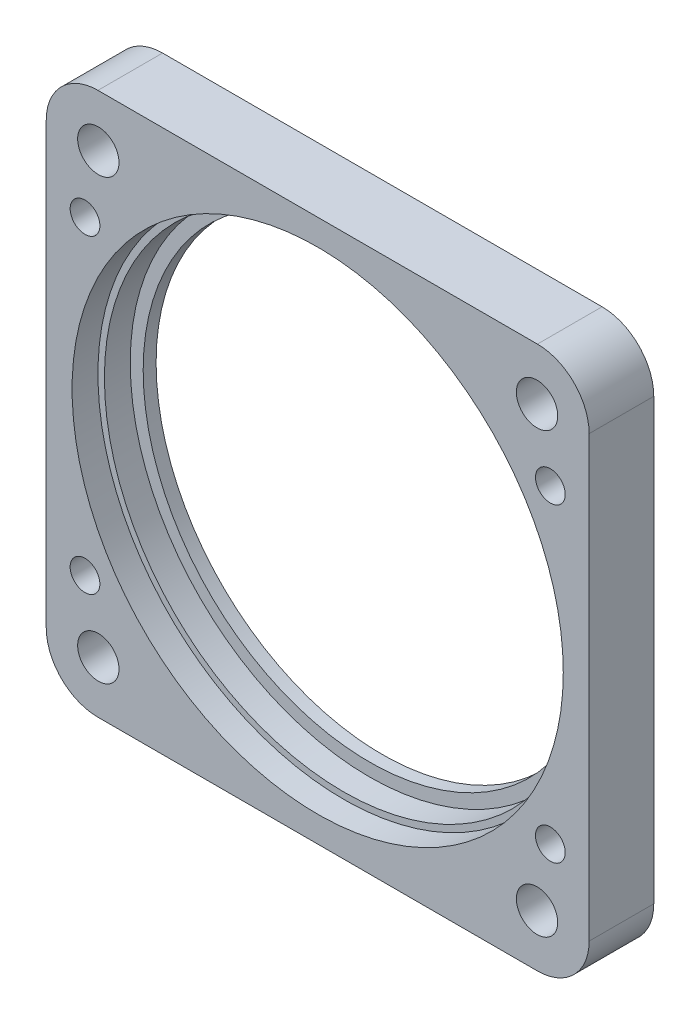
ISO-10303-21;
HEADER;
FILE_DESCRIPTION(('STEP AP214'),'2;1');
FILE_NAME('part.step','',(''),(''),'','','');
FILE_SCHEMA(('AUTOMOTIVE_DESIGN { 1 0 10303 214 1 1 1 1 }'));
ENDSEC;
DATA;
#1=APPLICATION_CONTEXT('core data for automotive mechanical design processes');
#2=APPLICATION_PROTOCOL_DEFINITION('international standard','automotive_design',2000,#1);
#3=PRODUCT_CONTEXT('',#1,'mechanical');
#4=PRODUCT('Part','Part','',(#3));
#5=PRODUCT_RELATED_PRODUCT_CATEGORY('part','',(#4));
#6=PRODUCT_DEFINITION_FORMATION('','',#4);
#7=PRODUCT_DEFINITION_CONTEXT('part definition',#1,'design');
#8=PRODUCT_DEFINITION('design','',#6,#7);
#9=PRODUCT_DEFINITION_SHAPE('','',#8);
#10=(LENGTH_UNIT() NAMED_UNIT(*) SI_UNIT(.MILLI.,.METRE.));
#11=(NAMED_UNIT(*) PLANE_ANGLE_UNIT() SI_UNIT($,.RADIAN.));
#12=(NAMED_UNIT(*) SI_UNIT($,.STERADIAN.) SOLID_ANGLE_UNIT());
#13=UNCERTAINTY_MEASURE_WITH_UNIT(LENGTH_MEASURE(1.E-05),#10,'distance_accuracy_value','');
#14=(GEOMETRIC_REPRESENTATION_CONTEXT(3) GLOBAL_UNCERTAINTY_ASSIGNED_CONTEXT((#13)) GLOBAL_UNIT_ASSIGNED_CONTEXT((#10,
#11,#12)) REPRESENTATION_CONTEXT('',''));
#15=CARTESIAN_POINT('',(0.,0.,0.));
#16=DIRECTION('',(0.,0.,1.));
#17=DIRECTION('',(1.,0.,0.));
#18=AXIS2_PLACEMENT_3D('',#15,#16,#17);
#19=CARTESIAN_POINT('',(18.,12.,5.));
#20=DIRECTION('',(0.,0.,-1.));
#21=DIRECTION('',(-1.,0.,0.));
#22=AXIS2_PLACEMENT_3D('',#19,#20,#21);
#23=CYLINDRICAL_SURFACE('',#22,1.15);
#24=CARTESIAN_POINT('',(18.,12.,5.));
#25=DIRECTION('',(0.,0.,-1.));
#26=DIRECTION('',(-1.,0.,0.));
#27=AXIS2_PLACEMENT_3D('',#24,#25,#26);
#28=CIRCLE('',#27,1.15);
#29=CARTESIAN_POINT('',(16.85,12.,5.));
#30=VERTEX_POINT('',#29);
#31=EDGE_CURVE('E199',#30,#30,#28,.T.);
#32=ORIENTED_EDGE('',*,*,#31,.F.);
#33=EDGE_LOOP('',(#32));
#34=FACE_BOUND('',#33,.T.);
#35=CARTESIAN_POINT('',(18.,12.,3.));
#36=DIRECTION('',(0.,0.,-1.));
#37=DIRECTION('',(-1.,0.,0.));
#38=AXIS2_PLACEMENT_3D('',#35,#36,#37);
#39=CIRCLE('',#38,1.15);
#40=CARTESIAN_POINT('',(16.85,12.,3.));
#41=VERTEX_POINT('',#40);
#42=EDGE_CURVE('E46',#41,#41,#39,.F.);
#43=ORIENTED_EDGE('',*,*,#42,.F.);
#44=EDGE_LOOP('',(#43));
#45=FACE_BOUND('',#44,.T.);
#46=ADVANCED_FACE('F42',(#34,#45),#23,.F.);
#47=CARTESIAN_POINT('',(-18.,-12.,5.));
#48=DIRECTION('',(0.,0.,-1.));
#49=DIRECTION('',(-1.,0.,0.));
#50=AXIS2_PLACEMENT_3D('',#47,#48,#49);
#51=CYLINDRICAL_SURFACE('',#50,1.15);
#52=CARTESIAN_POINT('',(-18.,-12.,5.));
#53=DIRECTION('',(0.,0.,-1.));
#54=DIRECTION('',(-1.,0.,0.));
#55=AXIS2_PLACEMENT_3D('',#52,#53,#54);
#56=CIRCLE('',#55,1.15);
#57=CARTESIAN_POINT('',(-19.15,-12.,5.));
#58=VERTEX_POINT('',#57);
#59=EDGE_CURVE('E190',#58,#58,#56,.T.);
#60=ORIENTED_EDGE('',*,*,#59,.F.);
#61=EDGE_LOOP('',(#60));
#62=FACE_BOUND('',#61,.T.);
#63=CARTESIAN_POINT('',(-18.,-12.,3.));
#64=DIRECTION('',(0.,0.,-1.));
#65=DIRECTION('',(-1.,0.,0.));
#66=AXIS2_PLACEMENT_3D('',#63,#64,#65);
#67=CIRCLE('',#66,1.15);
#68=CARTESIAN_POINT('',(-19.15,-12.,3.));
#69=VERTEX_POINT('',#68);
#70=EDGE_CURVE('E178',#69,#69,#67,.F.);
#71=ORIENTED_EDGE('',*,*,#70,.F.);
#72=EDGE_LOOP('',(#71));
#73=FACE_BOUND('',#72,.T.);
#74=ADVANCED_FACE('F262',(#62,#73),#51,.F.);
#75=CARTESIAN_POINT('',(0.,0.,-52.3259018078045));
#76=DIRECTION('',(0.,0.,1.));
#77=DIRECTION('',(1.,0.,0.));
#78=AXIS2_PLACEMENT_3D('',#75,#76,#77);
#79=CYLINDRICAL_SURFACE('',#78,18.5);
#80=CARTESIAN_POINT('',(0.,0.,1.));
#81=DIRECTION('',(0.,0.,1.));
#82=DIRECTION('',(1.,0.,0.));
#83=AXIS2_PLACEMENT_3D('',#80,#81,#82);
#84=CIRCLE('',#83,18.5);
#85=CARTESIAN_POINT('',(18.5,0.,1.));
#86=VERTEX_POINT('',#85);
#87=EDGE_CURVE('E149',#86,#86,#84,.F.);
#88=ORIENTED_EDGE('',*,*,#87,.T.);
#89=EDGE_LOOP('',(#88));
#90=FACE_BOUND('',#89,.T.);
#91=CARTESIAN_POINT('',(0.,0.,3.));
#92=DIRECTION('',(0.,0.,1.));
#93=DIRECTION('',(1.,0.,0.));
#94=AXIS2_PLACEMENT_3D('',#91,#92,#93);
#95=CIRCLE('',#94,18.5);
#96=CARTESIAN_POINT('',(18.5,0.,3.));
#97=VERTEX_POINT('',#96);
#98=EDGE_CURVE('E150',#97,#97,#95,.F.);
#99=ORIENTED_EDGE('',*,*,#98,.F.);
#100=EDGE_LOOP('',(#99));
#101=FACE_BOUND('',#100,.T.);
#102=ADVANCED_FACE('F268',(#90,#101),#79,.F.);
#103=CARTESIAN_POINT('',(0.,0.,0.));
#104=DIRECTION('',(0.,0.,1.));
#105=DIRECTION('',(1.,0.,0.));
#106=AXIS2_PLACEMENT_3D('',#103,#104,#105);
#107=CYLINDRICAL_SURFACE('',#106,17.5);
#108=CARTESIAN_POINT('',(0.,0.,0.));
#109=DIRECTION('',(0.,0.,1.));
#110=DIRECTION('',(1.,0.,0.));
#111=AXIS2_PLACEMENT_3D('',#108,#109,#110);
#112=CIRCLE('',#111,17.5);
#113=CARTESIAN_POINT('',(17.5,0.,0.));
#114=VERTEX_POINT('',#113);
#115=EDGE_CURVE('E148',#114,#114,#112,.T.);
#116=ORIENTED_EDGE('',*,*,#115,.F.);
#117=EDGE_LOOP('',(#116));
#118=FACE_BOUND('',#117,.T.);
#119=CARTESIAN_POINT('',(0.,0.,1.));
#120=DIRECTION('',(0.,0.,1.));
#121=DIRECTION('',(1.,0.,0.));
#122=AXIS2_PLACEMENT_3D('',#119,#120,#121);
#123=CIRCLE('',#122,17.5);
#124=CARTESIAN_POINT('',(17.5,0.,1.));
#125=VERTEX_POINT('',#124);
#126=EDGE_CURVE('E145',#125,#125,#123,.F.);
#127=ORIENTED_EDGE('',*,*,#126,.F.);
#128=EDGE_LOOP('',(#127));
#129=FACE_BOUND('',#128,.T.);
#130=ADVANCED_FACE('F307',(#118,#129),#107,.F.);
#131=CARTESIAN_POINT('',(21.,21.,5.));
#132=DIRECTION('',(-1.,0.,0.));
#133=DIRECTION('',(0.,-1.,0.));
#134=AXIS2_PLACEMENT_3D('',#131,#132,#133);
#135=PLANE('',#134);
#136=DIRECTION('',(0.,1.,0.));
#137=VECTOR('',#136,1.);
#138=CARTESIAN_POINT('',(21.,21.,5.));
#139=LINE('',#138,#137);
#140=CARTESIAN_POINT('',(21.,-17.,5.));
#141=VERTEX_POINT('',#140);
#142=CARTESIAN_POINT('',(21.,17.,5.));
#143=VERTEX_POINT('',#142);
#144=EDGE_CURVE('E136',#141,#143,#139,.T.);
#145=ORIENTED_EDGE('',*,*,#144,.F.);
#146=DIRECTION('',(0.,0.,-1.));
#147=VECTOR('',#146,1.);
#148=CARTESIAN_POINT('',(21.,-17.,5.));
#149=LINE('',#148,#147);
#150=CARTESIAN_POINT('',(21.,-17.,0.));
#151=VERTEX_POINT('',#150);
#152=EDGE_CURVE('E171',#141,#151,#149,.T.);
#153=ORIENTED_EDGE('',*,*,#152,.T.);
#154=DIRECTION('',(0.,1.,0.));
#155=VECTOR('',#154,1.);
#156=CARTESIAN_POINT('',(21.,21.,0.));
#157=LINE('',#156,#155);
#158=CARTESIAN_POINT('',(21.,17.,0.));
#159=VERTEX_POINT('',#158);
#160=EDGE_CURVE('E234',#151,#159,#157,.T.);
#161=ORIENTED_EDGE('',*,*,#160,.T.);
#162=DIRECTION('',(0.,0.,-1.));
#163=VECTOR('',#162,1.);
#164=CARTESIAN_POINT('',(21.,17.,5.));
#165=LINE('',#164,#163);
#166=EDGE_CURVE('E169',#159,#143,#165,.F.);
#167=ORIENTED_EDGE('',*,*,#166,.T.);
#168=EDGE_LOOP('',(#145,#153,#161,#167));
#169=FACE_BOUND('',#168,.T.);
#170=ADVANCED_FACE('F259',(#169),#135,.F.);
#171=CARTESIAN_POINT('',(-21.,21.,5.));
#172=DIRECTION('',(0.,-1.,0.));
#173=DIRECTION('',(0.,0.,-1.));
#174=AXIS2_PLACEMENT_3D('',#171,#172,#173);
#175=PLANE('',#174);
#176=DIRECTION('',(-1.,0.,0.));
#177=VECTOR('',#176,1.);
#178=CARTESIAN_POINT('',(-21.,21.,5.));
#179=LINE('',#178,#177);
#180=CARTESIAN_POINT('',(17.,21.,5.));
#181=VERTEX_POINT('',#180);
#182=CARTESIAN_POINT('',(-17.,21.,5.));
#183=VERTEX_POINT('',#182);
#184=EDGE_CURVE('E139',#181,#183,#179,.T.);
#185=ORIENTED_EDGE('',*,*,#184,.F.);
#186=DIRECTION('',(0.,0.,-1.));
#187=VECTOR('',#186,1.);
#188=CARTESIAN_POINT('',(17.,21.,5.));
#189=LINE('',#188,#187);
#190=CARTESIAN_POINT('',(17.,21.,0.));
#191=VERTEX_POINT('',#190);
#192=EDGE_CURVE('E13',#181,#191,#189,.T.);
#193=ORIENTED_EDGE('',*,*,#192,.T.);
#194=DIRECTION('',(-1.,0.,0.));
#195=VECTOR('',#194,1.);
#196=CARTESIAN_POINT('',(-21.,21.,0.));
#197=LINE('',#196,#195);
#198=CARTESIAN_POINT('',(-17.,21.,0.));
#199=VERTEX_POINT('',#198);
#200=EDGE_CURVE('E141',#191,#199,#197,.T.);
#201=ORIENTED_EDGE('',*,*,#200,.T.);
#202=DIRECTION('',(0.,0.,-1.));
#203=VECTOR('',#202,1.);
#204=CARTESIAN_POINT('',(-17.,21.,5.));
#205=LINE('',#204,#203);
#206=EDGE_CURVE('E51',#199,#183,#205,.F.);
#207=ORIENTED_EDGE('',*,*,#206,.T.);
#208=EDGE_LOOP('',(#185,#193,#201,#207));
#209=FACE_BOUND('',#208,.T.);
#210=ADVANCED_FACE('F243',(#209),#175,.F.);
#211=CARTESIAN_POINT('',(-21.,21.,5.));
#212=DIRECTION('',(1.,0.,0.));
#213=DIRECTION('',(0.,0.,-1.));
#214=AXIS2_PLACEMENT_3D('',#211,#212,#213);
#215=PLANE('',#214);
#216=DIRECTION('',(0.,-1.,0.));
#217=VECTOR('',#216,1.);
#218=CARTESIAN_POINT('',(-21.,21.,0.));
#219=LINE('',#218,#217);
#220=CARTESIAN_POINT('',(-21.,17.,0.));
#221=VERTEX_POINT('',#220);
#222=CARTESIAN_POINT('',(-21.,-17.,0.));
#223=VERTEX_POINT('',#222);
#224=EDGE_CURVE('E137',#221,#223,#219,.T.);
#225=ORIENTED_EDGE('',*,*,#224,.T.);
#226=DIRECTION('',(0.,0.,-1.));
#227=VECTOR('',#226,1.);
#228=CARTESIAN_POINT('',(-21.,-17.,5.));
#229=LINE('',#228,#227);
#230=CARTESIAN_POINT('',(-21.,-17.,5.));
#231=VERTEX_POINT('',#230);
#232=EDGE_CURVE('E115',#223,#231,#229,.F.);
#233=ORIENTED_EDGE('',*,*,#232,.T.);
#234=DIRECTION('',(0.,-1.,0.));
#235=VECTOR('',#234,1.);
#236=CARTESIAN_POINT('',(-21.,21.,5.));
#237=LINE('',#236,#235);
#238=CARTESIAN_POINT('',(-21.,17.,5.));
#239=VERTEX_POINT('',#238);
#240=EDGE_CURVE('E237',#239,#231,#237,.T.);
#241=ORIENTED_EDGE('',*,*,#240,.F.);
#242=DIRECTION('',(0.,0.,-1.));
#243=VECTOR('',#242,1.);
#244=CARTESIAN_POINT('',(-21.,17.,5.));
#245=LINE('',#244,#243);
#246=EDGE_CURVE('E120',#239,#221,#245,.T.);
#247=ORIENTED_EDGE('',*,*,#246,.T.);
#248=EDGE_LOOP('',(#225,#233,#241,#247));
#249=FACE_BOUND('',#248,.T.);
#250=ADVANCED_FACE('F251',(#249),#215,.F.);
#251=CARTESIAN_POINT('',(-21.,-21.,5.));
#252=DIRECTION('',(0.,1.,0.));
#253=DIRECTION('',(0.,0.,1.));
#254=AXIS2_PLACEMENT_3D('',#251,#252,#253);
#255=PLANE('',#254);
#256=DIRECTION('',(1.,0.,0.));
#257=VECTOR('',#256,1.);
#258=CARTESIAN_POINT('',(-21.,-21.,5.));
#259=LINE('',#258,#257);
#260=CARTESIAN_POINT('',(-17.,-21.,5.));
#261=VERTEX_POINT('',#260);
#262=CARTESIAN_POINT('',(17.,-21.,5.));
#263=VERTEX_POINT('',#262);
#264=EDGE_CURVE('E130',#261,#263,#259,.T.);
#265=ORIENTED_EDGE('',*,*,#264,.F.);
#266=DIRECTION('',(0.,0.,-1.));
#267=VECTOR('',#266,1.);
#268=CARTESIAN_POINT('',(-17.,-21.,5.));
#269=LINE('',#268,#267);
#270=CARTESIAN_POINT('',(-17.,-21.,0.));
#271=VERTEX_POINT('',#270);
#272=EDGE_CURVE('E114',#261,#271,#269,.T.);
#273=ORIENTED_EDGE('',*,*,#272,.T.);
#274=DIRECTION('',(1.,0.,0.));
#275=VECTOR('',#274,1.);
#276=CARTESIAN_POINT('',(-21.,-21.,0.));
#277=LINE('',#276,#275);
#278=CARTESIAN_POINT('',(17.,-21.,0.));
#279=VERTEX_POINT('',#278);
#280=EDGE_CURVE('E127',#271,#279,#277,.T.);
#281=ORIENTED_EDGE('',*,*,#280,.T.);
#282=DIRECTION('',(0.,0.,-1.));
#283=VECTOR('',#282,1.);
#284=CARTESIAN_POINT('',(17.,-21.,5.));
#285=LINE('',#284,#283);
#286=EDGE_CURVE('E132',#279,#263,#285,.F.);
#287=ORIENTED_EDGE('',*,*,#286,.T.);
#288=EDGE_LOOP('',(#265,#273,#281,#287));
#289=FACE_BOUND('',#288,.T.);
#290=ADVANCED_FACE('F126',(#289),#255,.F.);
#291=CARTESIAN_POINT('',(0.,0.,5.));
#292=DIRECTION('',(0.,0.,1.));
#293=DIRECTION('',(1.,0.,0.));
#294=AXIS2_PLACEMENT_3D('',#291,#292,#293);
#295=PLANE('',#294);
#296=CARTESIAN_POINT('',(18.,-12.,5.));
#297=DIRECTION('',(0.,0.,-1.));
#298=DIRECTION('',(1.,0.,0.));
#299=AXIS2_PLACEMENT_3D('',#296,#297,#298);
#300=CIRCLE('',#299,1.15);
#301=CARTESIAN_POINT('',(19.15,-12.,5.));
#302=VERTEX_POINT('',#301);
#303=EDGE_CURVE('E186',#302,#302,#300,.T.);
#304=ORIENTED_EDGE('',*,*,#303,.T.);
#305=EDGE_LOOP('',(#304));
#306=FACE_BOUND('',#305,.T.);
#307=ORIENTED_EDGE('',*,*,#59,.T.);
#308=EDGE_LOOP('',(#307));
#309=FACE_BOUND('',#308,.T.);
#310=CARTESIAN_POINT('',(-18.,12.,5.));
#311=DIRECTION('',(0.,0.,-1.));
#312=DIRECTION('',(1.,0.,0.));
#313=AXIS2_PLACEMENT_3D('',#310,#311,#312);
#314=CIRCLE('',#313,1.15);
#315=CARTESIAN_POINT('',(-16.85,12.,5.));
#316=VERTEX_POINT('',#315);
#317=EDGE_CURVE('E195',#316,#316,#314,.T.);
#318=ORIENTED_EDGE('',*,*,#317,.T.);
#319=EDGE_LOOP('',(#318));
#320=FACE_BOUND('',#319,.T.);
#321=ORIENTED_EDGE('',*,*,#31,.T.);
#322=EDGE_LOOP('',(#321));
#323=FACE_BOUND('',#322,.T.);
#324=CARTESIAN_POINT('',(-16.9705627484768,-16.9705627484768,5.));
#325=DIRECTION('',(0.,0.,1.));
#326=DIRECTION('',(1.,0.,0.));
#327=AXIS2_PLACEMENT_3D('',#324,#325,#326);
#328=CIRCLE('',#327,1.6);
#329=CARTESIAN_POINT('',(-15.3705627484768,-16.9705627484768,5.));
#330=VERTEX_POINT('',#329);
#331=EDGE_CURVE('E216',#330,#330,#328,.T.);
#332=ORIENTED_EDGE('',*,*,#331,.F.);
#333=EDGE_LOOP('',(#332));
#334=FACE_BOUND('',#333,.T.);
#335=CARTESIAN_POINT('',(16.9705627484774,-16.9705627484768,5.));
#336=DIRECTION('',(0.,0.,1.));
#337=DIRECTION('',(1.,0.,0.));
#338=AXIS2_PLACEMENT_3D('',#335,#336,#337);
#339=CIRCLE('',#338,1.6);
#340=CARTESIAN_POINT('',(18.5705627484774,-16.9705627484768,5.));
#341=VERTEX_POINT('',#340);
#342=EDGE_CURVE('E210',#341,#341,#339,.T.);
#343=ORIENTED_EDGE('',*,*,#342,.F.);
#344=EDGE_LOOP('',(#343));
#345=FACE_BOUND('',#344,.T.);
#346=CARTESIAN_POINT('',(16.9705627484775,16.9705627484774,5.));
#347=DIRECTION('',(0.,0.,1.));
#348=DIRECTION('',(1.,0.,0.));
#349=AXIS2_PLACEMENT_3D('',#346,#347,#348);
#350=CIRCLE('',#349,1.6);
#351=CARTESIAN_POINT('',(18.5705627484775,16.9705627484774,5.));
#352=VERTEX_POINT('',#351);
#353=EDGE_CURVE('E203',#352,#352,#350,.T.);
#354=ORIENTED_EDGE('',*,*,#353,.F.);
#355=EDGE_LOOP('',(#354));
#356=FACE_BOUND('',#355,.T.);
#357=CARTESIAN_POINT('',(-16.9705627484768,16.9705627484775,5.));
#358=DIRECTION('',(0.,0.,1.));
#359=DIRECTION('',(1.,0.,0.));
#360=AXIS2_PLACEMENT_3D('',#357,#358,#359);
#361=CIRCLE('',#360,1.6);
#362=CARTESIAN_POINT('',(-15.3705627484768,16.9705627484775,5.));
#363=VERTEX_POINT('',#362);
#364=EDGE_CURVE('E206',#363,#363,#361,.T.);
#365=ORIENTED_EDGE('',*,*,#364,.F.);
#366=EDGE_LOOP('',(#365));
#367=FACE_BOUND('',#366,.T.);
#368=CARTESIAN_POINT('',(0.,0.,5.));
#369=DIRECTION('',(0.,0.,1.));
#370=DIRECTION('',(1.,0.,0.));
#371=AXIS2_PLACEMENT_3D('',#368,#369,#370);
#372=CIRCLE('',#371,19.);
#373=CARTESIAN_POINT('',(19.,0.,5.));
#374=VERTEX_POINT('',#373);
#375=EDGE_CURVE('E224',#374,#374,#372,.T.);
#376=ORIENTED_EDGE('',*,*,#375,.F.);
#377=EDGE_LOOP('',(#376));
#378=FACE_BOUND('',#377,.T.);
#379=ORIENTED_EDGE('',*,*,#240,.T.);
#380=CARTESIAN_POINT('',(-17.,-17.,5.));
#381=DIRECTION('',(0.,0.,1.));
#382=DIRECTION('',(1.,0.,0.));
#383=AXIS2_PLACEMENT_3D('',#380,#381,#382);
#384=CIRCLE('',#383,4.);
#385=EDGE_CURVE('E167',#231,#261,#384,.T.);
#386=ORIENTED_EDGE('',*,*,#385,.T.);
#387=ORIENTED_EDGE('',*,*,#264,.T.);
#388=CARTESIAN_POINT('',(17.,-17.,5.));
#389=DIRECTION('',(0.,0.,1.));
#390=DIRECTION('',(1.,0.,0.));
#391=AXIS2_PLACEMENT_3D('',#388,#389,#390);
#392=CIRCLE('',#391,4.);
#393=EDGE_CURVE('E165',#263,#141,#392,.T.);
#394=ORIENTED_EDGE('',*,*,#393,.T.);
#395=ORIENTED_EDGE('',*,*,#144,.T.);
#396=CARTESIAN_POINT('',(17.,17.,5.));
#397=DIRECTION('',(0.,0.,1.));
#398=DIRECTION('',(1.,0.,0.));
#399=AXIS2_PLACEMENT_3D('',#396,#397,#398);
#400=CIRCLE('',#399,4.);
#401=EDGE_CURVE('E65',#143,#181,#400,.T.);
#402=ORIENTED_EDGE('',*,*,#401,.T.);
#403=ORIENTED_EDGE('',*,*,#184,.T.);
#404=CARTESIAN_POINT('',(-17.,17.,5.));
#405=DIRECTION('',(0.,0.,1.));
#406=DIRECTION('',(1.,0.,0.));
#407=AXIS2_PLACEMENT_3D('',#404,#405,#406);
#408=CIRCLE('',#407,4.);
#409=EDGE_CURVE('E162',#183,#239,#408,.T.);
#410=ORIENTED_EDGE('',*,*,#409,.T.);
#411=EDGE_LOOP('',(#379,#386,#387,#394,#395,#402,#403,#410));
#412=FACE_BOUND('',#411,.T.);
#413=ADVANCED_FACE('F249',(#306,#309,#320,#323,#334,#345,#356,#367,#378,#412),#295,.T.);
#414=CARTESIAN_POINT('',(0.,0.,0.));
#415=DIRECTION('',(0.,0.,1.));
#416=DIRECTION('',(1.,0.,0.));
#417=AXIS2_PLACEMENT_3D('',#414,#415,#416);
#418=PLANE('',#417);
#419=CARTESIAN_POINT('',(18.,-12.,0.));
#420=DIRECTION('',(0.,0.,-1.));
#421=DIRECTION('',(1.,0.,0.));
#422=AXIS2_PLACEMENT_3D('',#419,#420,#421);
#423=CIRCLE('',#422,2.);
#424=CARTESIAN_POINT('',(20.,-12.,0.));
#425=VERTEX_POINT('',#424);
#426=EDGE_CURVE('E321',#425,#425,#423,.T.);
#427=ORIENTED_EDGE('',*,*,#426,.F.);
#428=EDGE_LOOP('',(#427));
#429=FACE_BOUND('',#428,.T.);
#430=CARTESIAN_POINT('',(-18.,-12.,0.));
#431=DIRECTION('',(0.,0.,-1.));
#432=DIRECTION('',(-1.,0.,0.));
#433=AXIS2_PLACEMENT_3D('',#430,#431,#432);
#434=CIRCLE('',#433,2.);
#435=CARTESIAN_POINT('',(-20.,-12.,0.));
#436=VERTEX_POINT('',#435);
#437=EDGE_CURVE('E325',#436,#436,#434,.T.);
#438=ORIENTED_EDGE('',*,*,#437,.F.);
#439=EDGE_LOOP('',(#438));
#440=FACE_BOUND('',#439,.T.);
#441=CARTESIAN_POINT('',(-18.,12.,0.));
#442=DIRECTION('',(0.,0.,-1.));
#443=DIRECTION('',(1.,0.,0.));
#444=AXIS2_PLACEMENT_3D('',#441,#442,#443);
#445=CIRCLE('',#444,2.);
#446=CARTESIAN_POINT('',(-16.,12.,0.));
#447=VERTEX_POINT('',#446);
#448=EDGE_CURVE('E329',#447,#447,#445,.T.);
#449=ORIENTED_EDGE('',*,*,#448,.F.);
#450=EDGE_LOOP('',(#449));
#451=FACE_BOUND('',#450,.T.);
#452=CARTESIAN_POINT('',(18.,12.,0.));
#453=DIRECTION('',(0.,0.,-1.));
#454=DIRECTION('',(-1.,0.,0.));
#455=AXIS2_PLACEMENT_3D('',#452,#453,#454);
#456=CIRCLE('',#455,2.);
#457=CARTESIAN_POINT('',(16.,12.,0.));
#458=VERTEX_POINT('',#457);
#459=EDGE_CURVE('E333',#458,#458,#456,.T.);
#460=ORIENTED_EDGE('',*,*,#459,.F.);
#461=EDGE_LOOP('',(#460));
#462=FACE_BOUND('',#461,.T.);
#463=CARTESIAN_POINT('',(-16.9705627484768,-16.9705627484768,0.));
#464=DIRECTION('',(0.,0.,1.));
#465=DIRECTION('',(1.,0.,0.));
#466=AXIS2_PLACEMENT_3D('',#463,#464,#465);
#467=CIRCLE('',#466,1.6);
#468=CARTESIAN_POINT('',(-15.3705627484768,-16.9705627484768,0.));
#469=VERTEX_POINT('',#468);
#470=EDGE_CURVE('E202',#469,#469,#467,.T.);
#471=ORIENTED_EDGE('',*,*,#470,.T.);
#472=EDGE_LOOP('',(#471));
#473=FACE_BOUND('',#472,.T.);
#474=CARTESIAN_POINT('',(16.9705627484774,-16.9705627484768,0.));
#475=DIRECTION('',(0.,0.,1.));
#476=DIRECTION('',(1.,0.,0.));
#477=AXIS2_PLACEMENT_3D('',#474,#475,#476);
#478=CIRCLE('',#477,1.6);
#479=CARTESIAN_POINT('',(18.5705627484774,-16.9705627484768,0.));
#480=VERTEX_POINT('',#479);
#481=EDGE_CURVE('E213',#480,#480,#478,.T.);
#482=ORIENTED_EDGE('',*,*,#481,.T.);
#483=EDGE_LOOP('',(#482));
#484=FACE_BOUND('',#483,.T.);
#485=CARTESIAN_POINT('',(16.9705627484775,16.9705627484774,0.));
#486=DIRECTION('',(0.,0.,1.));
#487=DIRECTION('',(1.,0.,0.));
#488=AXIS2_PLACEMENT_3D('',#485,#486,#487);
#489=CIRCLE('',#488,1.6);
#490=CARTESIAN_POINT('',(18.5705627484775,16.9705627484774,0.));
#491=VERTEX_POINT('',#490);
#492=EDGE_CURVE('E207',#491,#491,#489,.T.);
#493=ORIENTED_EDGE('',*,*,#492,.T.);
#494=EDGE_LOOP('',(#493));
#495=FACE_BOUND('',#494,.T.);
#496=CARTESIAN_POINT('',(-16.9705627484768,16.9705627484775,0.));
#497=DIRECTION('',(0.,0.,1.));
#498=DIRECTION('',(1.,0.,0.));
#499=AXIS2_PLACEMENT_3D('',#496,#497,#498);
#500=CIRCLE('',#499,1.6);
#501=CARTESIAN_POINT('',(-15.3705627484768,16.9705627484775,0.));
#502=VERTEX_POINT('',#501);
#503=EDGE_CURVE('E221',#502,#502,#500,.T.);
#504=ORIENTED_EDGE('',*,*,#503,.T.);
#505=EDGE_LOOP('',(#504));
#506=FACE_BOUND('',#505,.T.);
#507=ORIENTED_EDGE('',*,*,#115,.T.);
#508=EDGE_LOOP('',(#507));
#509=FACE_BOUND('',#508,.T.);
#510=ORIENTED_EDGE('',*,*,#280,.F.);
#511=CARTESIAN_POINT('',(-17.,-17.,0.));
#512=DIRECTION('',(0.,0.,1.));
#513=DIRECTION('',(1.,0.,0.));
#514=AXIS2_PLACEMENT_3D('',#511,#512,#513);
#515=CIRCLE('',#514,4.);
#516=EDGE_CURVE('E110',#271,#223,#515,.F.);
#517=ORIENTED_EDGE('',*,*,#516,.T.);
#518=ORIENTED_EDGE('',*,*,#224,.F.);
#519=CARTESIAN_POINT('',(-17.,17.,0.));
#520=DIRECTION('',(0.,0.,1.));
#521=DIRECTION('',(1.,0.,0.));
#522=AXIS2_PLACEMENT_3D('',#519,#520,#521);
#523=CIRCLE('',#522,4.);
#524=EDGE_CURVE('E131',#221,#199,#523,.F.);
#525=ORIENTED_EDGE('',*,*,#524,.T.);
#526=ORIENTED_EDGE('',*,*,#200,.F.);
#527=CARTESIAN_POINT('',(17.,17.,0.));
#528=DIRECTION('',(0.,0.,1.));
#529=DIRECTION('',(1.,0.,0.));
#530=AXIS2_PLACEMENT_3D('',#527,#528,#529);
#531=CIRCLE('',#530,4.);
#532=EDGE_CURVE('E156',#191,#159,#531,.F.);
#533=ORIENTED_EDGE('',*,*,#532,.T.);
#534=ORIENTED_EDGE('',*,*,#160,.F.);
#535=CARTESIAN_POINT('',(17.,-17.,0.));
#536=DIRECTION('',(0.,0.,1.));
#537=DIRECTION('',(1.,0.,0.));
#538=AXIS2_PLACEMENT_3D('',#535,#536,#537);
#539=CIRCLE('',#538,4.);
#540=EDGE_CURVE('E121',#151,#279,#539,.F.);
#541=ORIENTED_EDGE('',*,*,#540,.T.);
#542=EDGE_LOOP('',(#510,#517,#518,#525,#526,#533,#534,#541));
#543=FACE_BOUND('',#542,.T.);
#544=ADVANCED_FACE('F134',(#429,#440,#451,#462,#473,#484,#495,#506,#509,#543),#418,.F.);
#545=CARTESIAN_POINT('',(0.,0.,1.));
#546=DIRECTION('',(0.,0.,1.));
#547=DIRECTION('',(1.,0.,0.));
#548=AXIS2_PLACEMENT_3D('',#545,#546,#547);
#549=PLANE('',#548);
#550=ORIENTED_EDGE('',*,*,#87,.F.);
#551=EDGE_LOOP('',(#550));
#552=FACE_BOUND('',#551,.T.);
#553=ORIENTED_EDGE('',*,*,#126,.T.);
#554=EDGE_LOOP('',(#553));
#555=FACE_BOUND('',#554,.T.);
#556=ADVANCED_FACE('F297',(#552,#555),#549,.T.);
#557=CARTESIAN_POINT('',(0.,0.,3.));
#558=DIRECTION('',(0.,0.,1.));
#559=DIRECTION('',(1.,0.,0.));
#560=AXIS2_PLACEMENT_3D('',#557,#558,#559);
#561=PLANE('',#560);
#562=CARTESIAN_POINT('',(0.,0.,3.));
#563=DIRECTION('',(0.,0.,1.));
#564=DIRECTION('',(1.,0.,0.));
#565=AXIS2_PLACEMENT_3D('',#562,#563,#564);
#566=CIRCLE('',#565,19.);
#567=CARTESIAN_POINT('',(19.,0.,3.));
#568=VERTEX_POINT('',#567);
#569=EDGE_CURVE('E153',#568,#568,#566,.F.);
#570=ORIENTED_EDGE('',*,*,#569,.F.);
#571=EDGE_LOOP('',(#570));
#572=FACE_BOUND('',#571,.T.);
#573=ORIENTED_EDGE('',*,*,#98,.T.);
#574=EDGE_LOOP('',(#573));
#575=FACE_BOUND('',#574,.T.);
#576=ADVANCED_FACE('F293',(#572,#575),#561,.T.);
#577=CARTESIAN_POINT('',(0.,0.,-52.7401153701776));
#578=DIRECTION('',(0.,0.,1.));
#579=DIRECTION('',(1.,0.,0.));
#580=AXIS2_PLACEMENT_3D('',#577,#578,#579);
#581=CYLINDRICAL_SURFACE('',#580,19.);
#582=ORIENTED_EDGE('',*,*,#569,.T.);
#583=EDGE_LOOP('',(#582));
#584=FACE_BOUND('',#583,.T.);
#585=ORIENTED_EDGE('',*,*,#375,.T.);
#586=EDGE_LOOP('',(#585));
#587=FACE_BOUND('',#586,.T.);
#588=ADVANCED_FACE('F296',(#584,#587),#581,.F.);
#589=CARTESIAN_POINT('',(-17.,-17.,5.));
#590=DIRECTION('',(0.,0.,-1.));
#591=DIRECTION('',(-1.,0.,0.));
#592=AXIS2_PLACEMENT_3D('',#589,#590,#591);
#593=CYLINDRICAL_SURFACE('',#592,4.);
#594=ORIENTED_EDGE('',*,*,#385,.F.);
#595=ORIENTED_EDGE('',*,*,#232,.F.);
#596=ORIENTED_EDGE('',*,*,#516,.F.);
#597=ORIENTED_EDGE('',*,*,#272,.F.);
#598=EDGE_LOOP('',(#594,#595,#596,#597));
#599=FACE_BOUND('',#598,.T.);
#600=ADVANCED_FACE('F113',(#599),#593,.T.);
#601=CARTESIAN_POINT('',(17.,-17.,5.));
#602=DIRECTION('',(0.,0.,-1.));
#603=DIRECTION('',(-1.,0.,0.));
#604=AXIS2_PLACEMENT_3D('',#601,#602,#603);
#605=CYLINDRICAL_SURFACE('',#604,4.);
#606=ORIENTED_EDGE('',*,*,#393,.F.);
#607=ORIENTED_EDGE('',*,*,#286,.F.);
#608=ORIENTED_EDGE('',*,*,#540,.F.);
#609=ORIENTED_EDGE('',*,*,#152,.F.);
#610=EDGE_LOOP('',(#606,#607,#608,#609));
#611=FACE_BOUND('',#610,.T.);
#612=ADVANCED_FACE('F562',(#611),#605,.T.);
#613=CARTESIAN_POINT('',(17.,17.,5.));
#614=DIRECTION('',(0.,0.,-1.));
#615=DIRECTION('',(-1.,0.,0.));
#616=AXIS2_PLACEMENT_3D('',#613,#614,#615);
#617=CYLINDRICAL_SURFACE('',#616,4.);
#618=ORIENTED_EDGE('',*,*,#401,.F.);
#619=ORIENTED_EDGE('',*,*,#166,.F.);
#620=ORIENTED_EDGE('',*,*,#532,.F.);
#621=ORIENTED_EDGE('',*,*,#192,.F.);
#622=EDGE_LOOP('',(#618,#619,#620,#621));
#623=FACE_BOUND('',#622,.T.);
#624=ADVANCED_FACE('F553',(#623),#617,.T.);
#625=CARTESIAN_POINT('',(-17.,17.,5.));
#626=DIRECTION('',(0.,0.,-1.));
#627=DIRECTION('',(-1.,0.,0.));
#628=AXIS2_PLACEMENT_3D('',#625,#626,#627);
#629=CYLINDRICAL_SURFACE('',#628,4.);
#630=ORIENTED_EDGE('',*,*,#409,.F.);
#631=ORIENTED_EDGE('',*,*,#206,.F.);
#632=ORIENTED_EDGE('',*,*,#524,.F.);
#633=ORIENTED_EDGE('',*,*,#246,.F.);
#634=EDGE_LOOP('',(#630,#631,#632,#633));
#635=FACE_BOUND('',#634,.T.);
#636=ADVANCED_FACE('F44',(#635),#629,.T.);
#637=CARTESIAN_POINT('',(-16.9705627484768,16.9705627484775,0.));
#638=DIRECTION('',(0.,0.,1.));
#639=DIRECTION('',(1.,0.,0.));
#640=AXIS2_PLACEMENT_3D('',#637,#638,#639);
#641=CYLINDRICAL_SURFACE('',#640,1.6);
#642=ORIENTED_EDGE('',*,*,#503,.F.);
#643=EDGE_LOOP('',(#642));
#644=FACE_BOUND('',#643,.T.);
#645=ORIENTED_EDGE('',*,*,#364,.T.);
#646=EDGE_LOOP('',(#645));
#647=FACE_BOUND('',#646,.T.);
#648=ADVANCED_FACE('F280',(#644,#647),#641,.F.);
#649=CARTESIAN_POINT('',(16.9705627484775,16.9705627484774,0.));
#650=DIRECTION('',(0.,0.,1.));
#651=DIRECTION('',(1.,0.,0.));
#652=AXIS2_PLACEMENT_3D('',#649,#650,#651);
#653=CYLINDRICAL_SURFACE('',#652,1.6);
#654=ORIENTED_EDGE('',*,*,#492,.F.);
#655=EDGE_LOOP('',(#654));
#656=FACE_BOUND('',#655,.T.);
#657=ORIENTED_EDGE('',*,*,#353,.T.);
#658=EDGE_LOOP('',(#657));
#659=FACE_BOUND('',#658,.T.);
#660=ADVANCED_FACE('F276',(#656,#659),#653,.F.);
#661=CARTESIAN_POINT('',(16.9705627484774,-16.9705627484768,0.));
#662=DIRECTION('',(0.,0.,1.));
#663=DIRECTION('',(1.,0.,0.));
#664=AXIS2_PLACEMENT_3D('',#661,#662,#663);
#665=CYLINDRICAL_SURFACE('',#664,1.6);
#666=ORIENTED_EDGE('',*,*,#481,.F.);
#667=EDGE_LOOP('',(#666));
#668=FACE_BOUND('',#667,.T.);
#669=ORIENTED_EDGE('',*,*,#342,.T.);
#670=EDGE_LOOP('',(#669));
#671=FACE_BOUND('',#670,.T.);
#672=ADVANCED_FACE('F279',(#668,#671),#665,.F.);
#673=CARTESIAN_POINT('',(-16.9705627484768,-16.9705627484768,0.));
#674=DIRECTION('',(0.,0.,1.));
#675=DIRECTION('',(1.,0.,0.));
#676=AXIS2_PLACEMENT_3D('',#673,#674,#675);
#677=CYLINDRICAL_SURFACE('',#676,1.6);
#678=ORIENTED_EDGE('',*,*,#470,.F.);
#679=EDGE_LOOP('',(#678));
#680=FACE_BOUND('',#679,.T.);
#681=ORIENTED_EDGE('',*,*,#331,.T.);
#682=EDGE_LOOP('',(#681));
#683=FACE_BOUND('',#682,.T.);
#684=ADVANCED_FACE('F284',(#680,#683),#677,.F.);
#685=CARTESIAN_POINT('',(-18.,12.,5.));
#686=DIRECTION('',(0.,0.,-1.));
#687=DIRECTION('',(-1.,0.,0.));
#688=AXIS2_PLACEMENT_3D('',#685,#686,#687);
#689=CYLINDRICAL_SURFACE('',#688,1.15);
#690=CARTESIAN_POINT('',(-18.,12.,3.));
#691=DIRECTION('',(0.,0.,1.));
#692=DIRECTION('',(1.,0.,0.));
#693=AXIS2_PLACEMENT_3D('',#690,#691,#692);
#694=CIRCLE('',#693,1.15);
#695=CARTESIAN_POINT('',(-16.85,12.,3.));
#696=VERTEX_POINT('',#695);
#697=EDGE_CURVE('E181',#696,#696,#694,.F.);
#698=ORIENTED_EDGE('',*,*,#697,.T.);
#699=EDGE_LOOP('',(#698));
#700=FACE_BOUND('',#699,.T.);
#701=ORIENTED_EDGE('',*,*,#317,.F.);
#702=EDGE_LOOP('',(#701));
#703=FACE_BOUND('',#702,.T.);
#704=ADVANCED_FACE('F288',(#700,#703),#689,.F.);
#705=CARTESIAN_POINT('',(18.,-12.,5.));
#706=DIRECTION('',(0.,0.,-1.));
#707=DIRECTION('',(-1.,0.,0.));
#708=AXIS2_PLACEMENT_3D('',#705,#706,#707);
#709=CYLINDRICAL_SURFACE('',#708,1.15);
#710=CARTESIAN_POINT('',(18.,-12.,3.));
#711=DIRECTION('',(0.,0.,1.));
#712=DIRECTION('',(1.,0.,0.));
#713=AXIS2_PLACEMENT_3D('',#710,#711,#712);
#714=CIRCLE('',#713,1.15);
#715=CARTESIAN_POINT('',(19.15,-12.,3.));
#716=VERTEX_POINT('',#715);
#717=EDGE_CURVE('E175',#716,#716,#714,.F.);
#718=ORIENTED_EDGE('',*,*,#717,.T.);
#719=EDGE_LOOP('',(#718));
#720=FACE_BOUND('',#719,.T.);
#721=ORIENTED_EDGE('',*,*,#303,.F.);
#722=EDGE_LOOP('',(#721));
#723=FACE_BOUND('',#722,.T.);
#724=ADVANCED_FACE('F275',(#720,#723),#709,.F.);
#725=CARTESIAN_POINT('',(18.,-12.,3.));
#726=DIRECTION('',(0.,0.,1.));
#727=DIRECTION('',(1.,0.,0.));
#728=AXIS2_PLACEMENT_3D('',#725,#726,#727);
#729=PLANE('',#728);
#730=CARTESIAN_POINT('',(18.,-12.,3.));
#731=DIRECTION('',(0.,0.,-1.));
#732=DIRECTION('',(1.,0.,0.));
#733=AXIS2_PLACEMENT_3D('',#730,#731,#732);
#734=CIRCLE('',#733,2.);
#735=CARTESIAN_POINT('',(20.,-12.,3.));
#736=VERTEX_POINT('',#735);
#737=EDGE_CURVE('E422',#736,#736,#734,.T.);
#738=ORIENTED_EDGE('',*,*,#737,.T.);
#739=EDGE_LOOP('',(#738));
#740=FACE_BOUND('',#739,.T.);
#741=ORIENTED_EDGE('',*,*,#717,.F.);
#742=EDGE_LOOP('',(#741));
#743=FACE_BOUND('',#742,.T.);
#744=ADVANCED_FACE('F378',(#740,#743),#729,.F.);
#745=CARTESIAN_POINT('',(18.,-12.,3.));
#746=DIRECTION('',(0.,0.,-1.));
#747=DIRECTION('',(-1.,0.,0.));
#748=AXIS2_PLACEMENT_3D('',#745,#746,#747);
#749=CYLINDRICAL_SURFACE('',#748,2.);
#750=ORIENTED_EDGE('',*,*,#737,.F.);
#751=EDGE_LOOP('',(#750));
#752=FACE_BOUND('',#751,.T.);
#753=ORIENTED_EDGE('',*,*,#426,.T.);
#754=EDGE_LOOP('',(#753));
#755=FACE_BOUND('',#754,.T.);
#756=ADVANCED_FACE('F392',(#752,#755),#749,.F.);
#757=CARTESIAN_POINT('',(-18.,-12.,3.));
#758=DIRECTION('',(0.,0.,-1.));
#759=DIRECTION('',(-1.,0.,0.));
#760=AXIS2_PLACEMENT_3D('',#757,#758,#759);
#761=PLANE('',#760);
#762=CARTESIAN_POINT('',(-18.,-12.,3.));
#763=DIRECTION('',(0.,0.,-1.));
#764=DIRECTION('',(-1.,0.,0.));
#765=AXIS2_PLACEMENT_3D('',#762,#763,#764);
#766=CIRCLE('',#765,2.);
#767=CARTESIAN_POINT('',(-20.,-12.,3.));
#768=VERTEX_POINT('',#767);
#769=EDGE_CURVE('E417',#768,#768,#766,.T.);
#770=ORIENTED_EDGE('',*,*,#769,.T.);
#771=EDGE_LOOP('',(#770));
#772=FACE_BOUND('',#771,.T.);
#773=ORIENTED_EDGE('',*,*,#70,.T.);
#774=EDGE_LOOP('',(#773));
#775=FACE_BOUND('',#774,.T.);
#776=ADVANCED_FACE('F396',(#772,#775),#761,.T.);
#777=CARTESIAN_POINT('',(-18.,-12.,3.));
#778=DIRECTION('',(0.,0.,-1.));
#779=DIRECTION('',(-1.,0.,0.));
#780=AXIS2_PLACEMENT_3D('',#777,#778,#779);
#781=CYLINDRICAL_SURFACE('',#780,2.);
#782=ORIENTED_EDGE('',*,*,#769,.F.);
#783=EDGE_LOOP('',(#782));
#784=FACE_BOUND('',#783,.T.);
#785=ORIENTED_EDGE('',*,*,#437,.T.);
#786=EDGE_LOOP('',(#785));
#787=FACE_BOUND('',#786,.T.);
#788=ADVANCED_FACE('F400',(#784,#787),#781,.F.);
#789=CARTESIAN_POINT('',(-18.,12.,3.));
#790=DIRECTION('',(0.,0.,1.));
#791=DIRECTION('',(1.,0.,0.));
#792=AXIS2_PLACEMENT_3D('',#789,#790,#791);
#793=PLANE('',#792);
#794=CARTESIAN_POINT('',(-18.,12.,3.));
#795=DIRECTION('',(0.,0.,-1.));
#796=DIRECTION('',(1.,0.,0.));
#797=AXIS2_PLACEMENT_3D('',#794,#795,#796);
#798=CIRCLE('',#797,2.);
#799=CARTESIAN_POINT('',(-16.,12.,3.));
#800=VERTEX_POINT('',#799);
#801=EDGE_CURVE('E365',#800,#800,#798,.T.);
#802=ORIENTED_EDGE('',*,*,#801,.T.);
#803=EDGE_LOOP('',(#802));
#804=FACE_BOUND('',#803,.T.);
#805=ORIENTED_EDGE('',*,*,#697,.F.);
#806=EDGE_LOOP('',(#805));
#807=FACE_BOUND('',#806,.T.);
#808=ADVANCED_FACE('F404',(#804,#807),#793,.F.);
#809=CARTESIAN_POINT('',(-18.,12.,3.));
#810=DIRECTION('',(0.,0.,-1.));
#811=DIRECTION('',(-1.,0.,0.));
#812=AXIS2_PLACEMENT_3D('',#809,#810,#811);
#813=CYLINDRICAL_SURFACE('',#812,2.);
#814=ORIENTED_EDGE('',*,*,#801,.F.);
#815=EDGE_LOOP('',(#814));
#816=FACE_BOUND('',#815,.T.);
#817=ORIENTED_EDGE('',*,*,#448,.T.);
#818=EDGE_LOOP('',(#817));
#819=FACE_BOUND('',#818,.T.);
#820=ADVANCED_FACE('F388',(#816,#819),#813,.F.);
#821=CARTESIAN_POINT('',(18.,12.,3.));
#822=DIRECTION('',(0.,0.,-1.));
#823=DIRECTION('',(-1.,0.,0.));
#824=AXIS2_PLACEMENT_3D('',#821,#822,#823);
#825=PLANE('',#824);
#826=CARTESIAN_POINT('',(18.,12.,3.));
#827=DIRECTION('',(0.,0.,-1.));
#828=DIRECTION('',(-1.,0.,0.));
#829=AXIS2_PLACEMENT_3D('',#826,#827,#828);
#830=CIRCLE('',#829,2.);
#831=CARTESIAN_POINT('',(16.,12.,3.));
#832=VERTEX_POINT('',#831);
#833=EDGE_CURVE('E179',#832,#832,#830,.T.);
#834=ORIENTED_EDGE('',*,*,#833,.T.);
#835=EDGE_LOOP('',(#834));
#836=FACE_BOUND('',#835,.T.);
#837=ORIENTED_EDGE('',*,*,#42,.T.);
#838=EDGE_LOOP('',(#837));
#839=FACE_BOUND('',#838,.T.);
#840=ADVANCED_FACE('F384',(#836,#839),#825,.T.);
#841=CARTESIAN_POINT('',(18.,12.,3.));
#842=DIRECTION('',(0.,0.,-1.));
#843=DIRECTION('',(-1.,0.,0.));
#844=AXIS2_PLACEMENT_3D('',#841,#842,#843);
#845=CYLINDRICAL_SURFACE('',#844,2.);
#846=ORIENTED_EDGE('',*,*,#833,.F.);
#847=EDGE_LOOP('',(#846));
#848=FACE_BOUND('',#847,.T.);
#849=ORIENTED_EDGE('',*,*,#459,.T.);
#850=EDGE_LOOP('',(#849));
#851=FACE_BOUND('',#850,.T.);
#852=ADVANCED_FACE('F381',(#848,#851),#845,.F.);
#853=CLOSED_SHELL('',(#46,#74,#102,#130,#170,#210,#250,#290,#413,#544,#556,#576,#588,#600,#612,
#624,#636,#648,#660,#672,#684,#704,#724,#744,#756,#776,#788,#808,#820,#840,#852));
#854=MANIFOLD_SOLID_BREP('B2',#853);
#855=ADVANCED_BREP_SHAPE_REPRESENTATION('',(#18,#854),#14);
#856=SHAPE_DEFINITION_REPRESENTATION(#9,#855);
ENDSEC;
END-ISO-10303-21;
